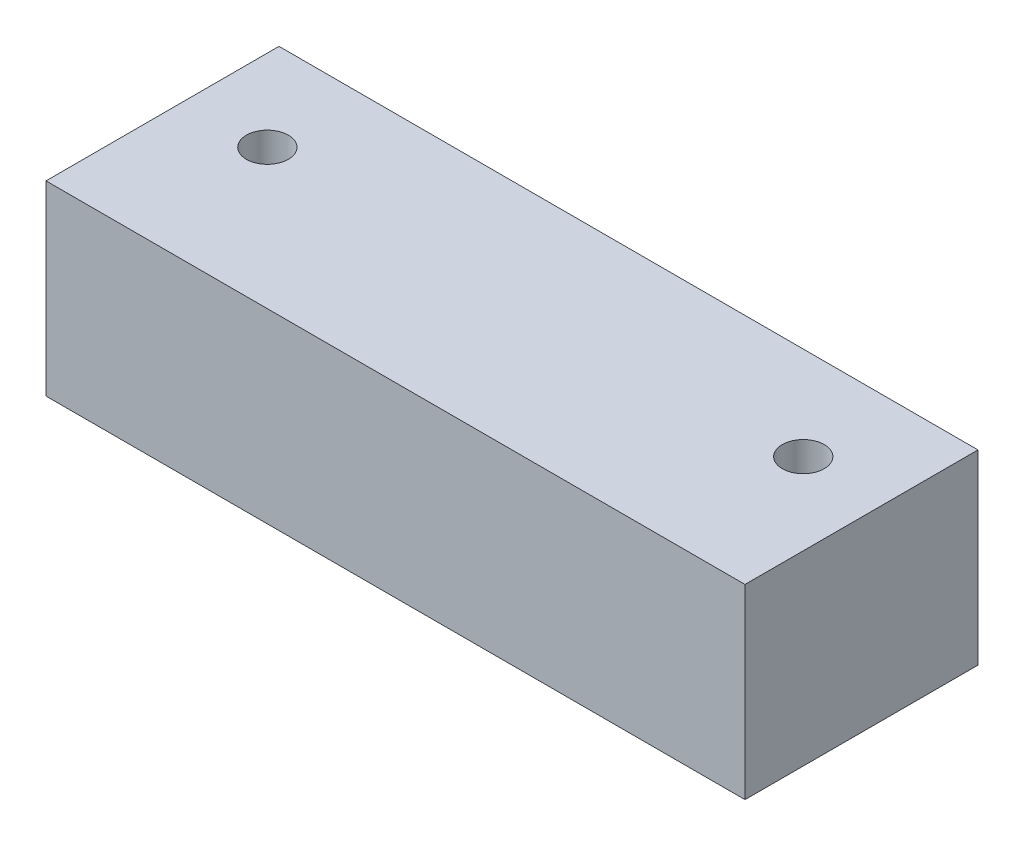
ISO-10303-21;
HEADER;
FILE_DESCRIPTION(('STEP AP214'),'2;1');
FILE_NAME('part.step','',(''),(''),'','','');
FILE_SCHEMA(('AUTOMOTIVE_DESIGN { 1 0 10303 214 1 1 1 1 }'));
ENDSEC;
DATA;
#1=APPLICATION_CONTEXT('core data for automotive mechanical design processes');
#2=APPLICATION_PROTOCOL_DEFINITION('international standard','automotive_design',2000,#1);
#3=PRODUCT_CONTEXT('',#1,'mechanical');
#4=PRODUCT('Part','Part','',(#3));
#5=PRODUCT_RELATED_PRODUCT_CATEGORY('part','',(#4));
#6=PRODUCT_DEFINITION_FORMATION('','',#4);
#7=PRODUCT_DEFINITION_CONTEXT('part definition',#1,'design');
#8=PRODUCT_DEFINITION('design','',#6,#7);
#9=PRODUCT_DEFINITION_SHAPE('','',#8);
#10=(LENGTH_UNIT() NAMED_UNIT(*) SI_UNIT(.MILLI.,.METRE.));
#11=(NAMED_UNIT(*) PLANE_ANGLE_UNIT() SI_UNIT($,.RADIAN.));
#12=(NAMED_UNIT(*) SI_UNIT($,.STERADIAN.) SOLID_ANGLE_UNIT());
#13=UNCERTAINTY_MEASURE_WITH_UNIT(LENGTH_MEASURE(1.E-05),#10,'distance_accuracy_value','');
#14=(GEOMETRIC_REPRESENTATION_CONTEXT(3) GLOBAL_UNCERTAINTY_ASSIGNED_CONTEXT((#13)) GLOBAL_UNIT_ASSIGNED_CONTEXT((#10,
#11,#12)) REPRESENTATION_CONTEXT('',''));
#15=CARTESIAN_POINT('',(0.,0.,0.));
#16=DIRECTION('',(0.,0.,1.));
#17=DIRECTION('',(1.,0.,0.));
#18=AXIS2_PLACEMENT_3D('',#15,#16,#17);
#19=CARTESIAN_POINT('',(-150.,-40.,50.));
#20=DIRECTION('',(1.,0.,0.));
#21=DIRECTION('',(0.,0.,-1.));
#22=AXIS2_PLACEMENT_3D('',#19,#20,#21);
#23=PLANE('',#22);
#24=DIRECTION('',(0.,-1.,0.));
#25=VECTOR('',#24,1.);
#26=CARTESIAN_POINT('',(-150.,-40.,-50.));
#27=LINE('',#26,#25);
#28=CARTESIAN_POINT('',(-150.,40.,-50.));
#29=VERTEX_POINT('',#28);
#30=CARTESIAN_POINT('',(-150.,-40.,-50.));
#31=VERTEX_POINT('',#30);
#32=EDGE_CURVE('E96',#29,#31,#27,.T.);
#33=ORIENTED_EDGE('',*,*,#32,.T.);
#34=DIRECTION('',(0.,0.,-1.));
#35=VECTOR('',#34,1.);
#36=CARTESIAN_POINT('',(-150.,-40.,50.));
#37=LINE('',#36,#35);
#38=CARTESIAN_POINT('',(-150.,-40.,50.));
#39=VERTEX_POINT('',#38);
#40=EDGE_CURVE('E11',#39,#31,#37,.T.);
#41=ORIENTED_EDGE('',*,*,#40,.F.);
#42=DIRECTION('',(0.,-1.,0.));
#43=VECTOR('',#42,1.);
#44=CARTESIAN_POINT('',(-150.,-40.,50.));
#45=LINE('',#44,#43);
#46=CARTESIAN_POINT('',(-150.,40.,50.));
#47=VERTEX_POINT('',#46);
#48=EDGE_CURVE('E84',#47,#39,#45,.T.);
#49=ORIENTED_EDGE('',*,*,#48,.F.);
#50=DIRECTION('',(0.,0.,-1.));
#51=VECTOR('',#50,1.);
#52=CARTESIAN_POINT('',(-150.,40.,50.));
#53=LINE('',#52,#51);
#54=EDGE_CURVE('E92',#47,#29,#53,.T.);
#55=ORIENTED_EDGE('',*,*,#54,.T.);
#56=EDGE_LOOP('',(#33,#41,#49,#55));
#57=FACE_BOUND('',#56,.T.);
#58=ADVANCED_FACE('F33',(#57),#23,.F.);
#59=CARTESIAN_POINT('',(-150.,-40.,50.));
#60=DIRECTION('',(0.,1.,0.));
#61=DIRECTION('',(0.,0.,1.));
#62=AXIS2_PLACEMENT_3D('',#59,#60,#61);
#63=PLANE('',#62);
#64=CARTESIAN_POINT('',(115.,-40.,-10.));
#65=DIRECTION('',(0.,1.,0.));
#66=DIRECTION('',(0.,0.,1.));
#67=AXIS2_PLACEMENT_3D('',#64,#65,#66);
#68=CIRCLE('',#67,9.);
#69=CARTESIAN_POINT('',(115.,-40.,-1.00000000000001));
#70=VERTEX_POINT('',#69);
#71=EDGE_CURVE('E115',#70,#70,#68,.T.);
#72=ORIENTED_EDGE('',*,*,#71,.T.);
#73=EDGE_LOOP('',(#72));
#74=FACE_BOUND('',#73,.T.);
#75=CARTESIAN_POINT('',(-115.,-40.,-10.));
#76=DIRECTION('',(0.,1.,0.));
#77=DIRECTION('',(0.,0.,1.));
#78=AXIS2_PLACEMENT_3D('',#75,#76,#77);
#79=CIRCLE('',#78,9.);
#80=CARTESIAN_POINT('',(-115.,-40.,-1.00000000000001));
#81=VERTEX_POINT('',#80);
#82=EDGE_CURVE('E99',#81,#81,#79,.T.);
#83=ORIENTED_EDGE('',*,*,#82,.T.);
#84=EDGE_LOOP('',(#83));
#85=FACE_BOUND('',#84,.T.);
#86=DIRECTION('',(1.,0.,0.));
#87=VECTOR('',#86,1.);
#88=CARTESIAN_POINT('',(-150.,-40.,-50.));
#89=LINE('',#88,#87);
#90=CARTESIAN_POINT('',(150.,-40.,-50.));
#91=VERTEX_POINT('',#90);
#92=EDGE_CURVE('E88',#31,#91,#89,.T.);
#93=ORIENTED_EDGE('',*,*,#92,.T.);
#94=DIRECTION('',(0.,0.,-1.));
#95=VECTOR('',#94,1.);
#96=CARTESIAN_POINT('',(150.,-40.,50.));
#97=LINE('',#96,#95);
#98=CARTESIAN_POINT('',(150.,-40.,50.));
#99=VERTEX_POINT('',#98);
#100=EDGE_CURVE('E41',#99,#91,#97,.T.);
#101=ORIENTED_EDGE('',*,*,#100,.F.);
#102=DIRECTION('',(1.,0.,0.));
#103=VECTOR('',#102,1.);
#104=CARTESIAN_POINT('',(-150.,-40.,50.));
#105=LINE('',#104,#103);
#106=EDGE_CURVE('E79',#39,#99,#105,.T.);
#107=ORIENTED_EDGE('',*,*,#106,.F.);
#108=ORIENTED_EDGE('',*,*,#40,.T.);
#109=EDGE_LOOP('',(#93,#101,#107,#108));
#110=FACE_BOUND('',#109,.T.);
#111=ADVANCED_FACE('F87',(#74,#85,#110),#63,.F.);
#112=CARTESIAN_POINT('',(150.,-40.,50.));
#113=DIRECTION('',(-1.,0.,0.));
#114=DIRECTION('',(0.,-1.,0.));
#115=AXIS2_PLACEMENT_3D('',#112,#113,#114);
#116=PLANE('',#115);
#117=DIRECTION('',(0.,1.,0.));
#118=VECTOR('',#117,1.);
#119=CARTESIAN_POINT('',(150.,-40.,-50.));
#120=LINE('',#119,#118);
#121=CARTESIAN_POINT('',(150.,40.,-50.));
#122=VERTEX_POINT('',#121);
#123=EDGE_CURVE('E66',#91,#122,#120,.T.);
#124=ORIENTED_EDGE('',*,*,#123,.T.);
#125=DIRECTION('',(0.,0.,-1.));
#126=VECTOR('',#125,1.);
#127=CARTESIAN_POINT('',(150.,40.,50.));
#128=LINE('',#127,#126);
#129=CARTESIAN_POINT('',(150.,40.,50.));
#130=VERTEX_POINT('',#129);
#131=EDGE_CURVE('E89',#130,#122,#128,.T.);
#132=ORIENTED_EDGE('',*,*,#131,.F.);
#133=DIRECTION('',(0.,1.,0.));
#134=VECTOR('',#133,1.);
#135=CARTESIAN_POINT('',(150.,-40.,50.));
#136=LINE('',#135,#134);
#137=EDGE_CURVE('E82',#99,#130,#136,.T.);
#138=ORIENTED_EDGE('',*,*,#137,.F.);
#139=ORIENTED_EDGE('',*,*,#100,.T.);
#140=EDGE_LOOP('',(#124,#132,#138,#139));
#141=FACE_BOUND('',#140,.T.);
#142=ADVANCED_FACE('F90',(#141),#116,.F.);
#143=CARTESIAN_POINT('',(-150.,40.,50.));
#144=DIRECTION('',(0.,-1.,0.));
#145=DIRECTION('',(1.,0.,0.));
#146=AXIS2_PLACEMENT_3D('',#143,#144,#145);
#147=PLANE('',#146);
#148=CARTESIAN_POINT('',(115.,40.,-10.));
#149=DIRECTION('',(0.,1.,0.));
#150=DIRECTION('',(0.,0.,1.));
#151=AXIS2_PLACEMENT_3D('',#148,#149,#150);
#152=CIRCLE('',#151,9.);
#153=CARTESIAN_POINT('',(115.,40.,-1.00000000000001));
#154=VERTEX_POINT('',#153);
#155=EDGE_CURVE('E118',#154,#154,#152,.T.);
#156=ORIENTED_EDGE('',*,*,#155,.F.);
#157=EDGE_LOOP('',(#156));
#158=FACE_BOUND('',#157,.T.);
#159=CARTESIAN_POINT('',(-115.,40.,-10.));
#160=DIRECTION('',(0.,1.,0.));
#161=DIRECTION('',(0.,0.,1.));
#162=AXIS2_PLACEMENT_3D('',#159,#160,#161);
#163=CIRCLE('',#162,9.);
#164=CARTESIAN_POINT('',(-115.,40.,-1.00000000000001));
#165=VERTEX_POINT('',#164);
#166=EDGE_CURVE('E112',#165,#165,#163,.T.);
#167=ORIENTED_EDGE('',*,*,#166,.F.);
#168=EDGE_LOOP('',(#167));
#169=FACE_BOUND('',#168,.T.);
#170=DIRECTION('',(-1.,0.,0.));
#171=VECTOR('',#170,1.);
#172=CARTESIAN_POINT('',(-150.,40.,-50.));
#173=LINE('',#172,#171);
#174=EDGE_CURVE('E72',#122,#29,#173,.T.);
#175=ORIENTED_EDGE('',*,*,#174,.T.);
#176=ORIENTED_EDGE('',*,*,#54,.F.);
#177=DIRECTION('',(-1.,0.,0.));
#178=VECTOR('',#177,1.);
#179=CARTESIAN_POINT('',(-150.,40.,50.));
#180=LINE('',#179,#178);
#181=EDGE_CURVE('E49',#130,#47,#180,.T.);
#182=ORIENTED_EDGE('',*,*,#181,.F.);
#183=ORIENTED_EDGE('',*,*,#131,.T.);
#184=EDGE_LOOP('',(#175,#176,#182,#183));
#185=FACE_BOUND('',#184,.T.);
#186=ADVANCED_FACE('F104',(#158,#169,#185),#147,.F.);
#187=CARTESIAN_POINT('',(0.,0.,50.));
#188=DIRECTION('',(0.,0.,-1.));
#189=DIRECTION('',(-1.,0.,0.));
#190=AXIS2_PLACEMENT_3D('',#187,#188,#189);
#191=PLANE('',#190);
#192=ORIENTED_EDGE('',*,*,#48,.T.);
#193=ORIENTED_EDGE('',*,*,#106,.T.);
#194=ORIENTED_EDGE('',*,*,#137,.T.);
#195=ORIENTED_EDGE('',*,*,#181,.T.);
#196=EDGE_LOOP('',(#192,#193,#194,#195));
#197=FACE_BOUND('',#196,.T.);
#198=ADVANCED_FACE('F80',(#197),#191,.F.);
#199=CARTESIAN_POINT('',(0.,0.,-50.));
#200=DIRECTION('',(0.,0.,-1.));
#201=DIRECTION('',(-1.,0.,0.));
#202=AXIS2_PLACEMENT_3D('',#199,#200,#201);
#203=PLANE('',#202);
#204=ORIENTED_EDGE('',*,*,#32,.F.);
#205=ORIENTED_EDGE('',*,*,#174,.F.);
#206=ORIENTED_EDGE('',*,*,#123,.F.);
#207=ORIENTED_EDGE('',*,*,#92,.F.);
#208=EDGE_LOOP('',(#204,#205,#206,#207));
#209=FACE_BOUND('',#208,.T.);
#210=ADVANCED_FACE('F107',(#209),#203,.T.);
#211=CARTESIAN_POINT('',(-115.,-40.,-10.));
#212=DIRECTION('',(0.,1.,0.));
#213=DIRECTION('',(0.,0.,1.));
#214=AXIS2_PLACEMENT_3D('',#211,#212,#213);
#215=CYLINDRICAL_SURFACE('',#214,9.);
#216=ORIENTED_EDGE('',*,*,#82,.F.);
#217=EDGE_LOOP('',(#216));
#218=FACE_BOUND('',#217,.T.);
#219=ORIENTED_EDGE('',*,*,#166,.T.);
#220=EDGE_LOOP('',(#219));
#221=FACE_BOUND('',#220,.T.);
#222=ADVANCED_FACE('F129',(#218,#221),#215,.F.);
#223=CARTESIAN_POINT('',(115.,-40.,-10.));
#224=DIRECTION('',(0.,1.,0.));
#225=DIRECTION('',(0.,0.,1.));
#226=AXIS2_PLACEMENT_3D('',#223,#224,#225);
#227=CYLINDRICAL_SURFACE('',#226,9.);
#228=ORIENTED_EDGE('',*,*,#71,.F.);
#229=EDGE_LOOP('',(#228));
#230=FACE_BOUND('',#229,.T.);
#231=ORIENTED_EDGE('',*,*,#155,.T.);
#232=EDGE_LOOP('',(#231));
#233=FACE_BOUND('',#232,.T.);
#234=ADVANCED_FACE('F122',(#230,#233),#227,.F.);
#235=CLOSED_SHELL('',(#58,#111,#142,#186,#198,#210,#222,#234));
#236=MANIFOLD_SOLID_BREP('B2',#235);
#237=ADVANCED_BREP_SHAPE_REPRESENTATION('',(#18,#236),#14);
#238=SHAPE_DEFINITION_REPRESENTATION(#9,#237);
ENDSEC;
END-ISO-10303-21;
